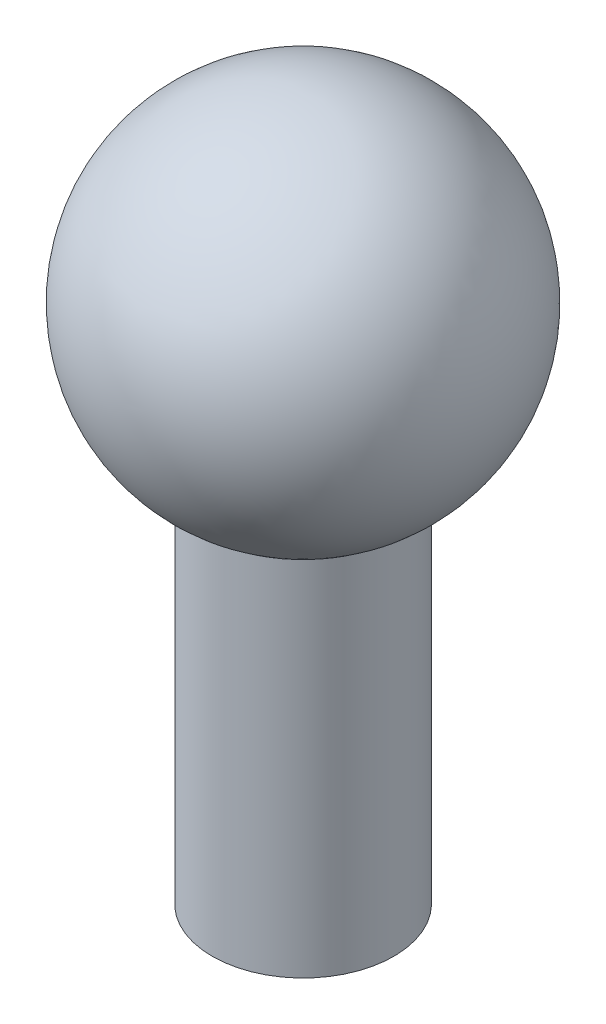
ISO-10303-21;
HEADER;
FILE_DESCRIPTION(('STEP AP214'),'2;1');
FILE_NAME('part.step','',(''),(''),'','','');
FILE_SCHEMA(('AUTOMOTIVE_DESIGN { 1 0 10303 214 1 1 1 1 }'));
ENDSEC;
DATA;
#1=APPLICATION_CONTEXT('core data for automotive mechanical design processes');
#2=APPLICATION_PROTOCOL_DEFINITION('international standard','automotive_design',2000,#1);
#3=PRODUCT_CONTEXT('',#1,'mechanical');
#4=PRODUCT('Part','Part','',(#3));
#5=PRODUCT_RELATED_PRODUCT_CATEGORY('part','',(#4));
#6=PRODUCT_DEFINITION_FORMATION('','',#4);
#7=PRODUCT_DEFINITION_CONTEXT('part definition',#1,'design');
#8=PRODUCT_DEFINITION('design','',#6,#7);
#9=PRODUCT_DEFINITION_SHAPE('','',#8);
#10=(LENGTH_UNIT() NAMED_UNIT(*) SI_UNIT(.MILLI.,.METRE.));
#11=(NAMED_UNIT(*) PLANE_ANGLE_UNIT() SI_UNIT($,.RADIAN.));
#12=(NAMED_UNIT(*) SI_UNIT($,.STERADIAN.) SOLID_ANGLE_UNIT());
#13=UNCERTAINTY_MEASURE_WITH_UNIT(LENGTH_MEASURE(1.E-05),#10,'distance_accuracy_value','');
#14=(GEOMETRIC_REPRESENTATION_CONTEXT(3) GLOBAL_UNCERTAINTY_ASSIGNED_CONTEXT((#13)) GLOBAL_UNIT_ASSIGNED_CONTEXT((#10,
#11,#12)) REPRESENTATION_CONTEXT('',''));
#15=CARTESIAN_POINT('',(0.,0.,0.));
#16=DIRECTION('',(0.,0.,1.));
#17=DIRECTION('',(1.,0.,0.));
#18=AXIS2_PLACEMENT_3D('',#15,#16,#17);
#19=CARTESIAN_POINT('',(0.,40.,0.));
#20=DIRECTION('',(0.,-1.,0.));
#21=DIRECTION('',(0.,0.,-1.));
#22=AXIS2_PLACEMENT_3D('',#19,#20,#21);
#23=CYLINDRICAL_SURFACE('',#22,10.);
#24=CARTESIAN_POINT('',(0.,40.,0.));
#25=DIRECTION('',(0.,1.,0.));
#26=DIRECTION('',(0.,0.,1.));
#27=AXIS2_PLACEMENT_3D('',#24,#25,#26);
#28=CIRCLE('',#27,10.);
#29=CARTESIAN_POINT('',(0.,40.,10.));
#30=VERTEX_POINT('',#29);
#31=EDGE_CURVE('E44',#30,#30,#28,.T.);
#32=ORIENTED_EDGE('',*,*,#31,.F.);
#33=EDGE_LOOP('',(#32));
#34=FACE_BOUND('',#33,.T.);
#35=CARTESIAN_POINT('',(0.,0.,0.));
#36=DIRECTION('',(0.,1.,0.));
#37=DIRECTION('',(0.,0.,1.));
#38=AXIS2_PLACEMENT_3D('',#35,#36,#37);
#39=CIRCLE('',#38,10.);
#40=CARTESIAN_POINT('',(0.,0.,10.));
#41=VERTEX_POINT('',#40);
#42=EDGE_CURVE('E47',#41,#41,#39,.T.);
#43=ORIENTED_EDGE('',*,*,#42,.T.);
#44=EDGE_LOOP('',(#43));
#45=FACE_BOUND('',#44,.T.);
#46=ADVANCED_FACE('F32',(#34,#45),#23,.T.);
#47=CARTESIAN_POINT('',(0.,40.,0.));
#48=DIRECTION('',(0.,1.,0.));
#49=DIRECTION('',(0.,0.,1.));
#50=AXIS2_PLACEMENT_3D('',#47,#48,#49);
#51=PLANE('',#50);
#52=CARTESIAN_POINT('',(0.,40.,-3.49148133884313E-12));
#53=DIRECTION('',(0.,1.,0.));
#54=DIRECTION('',(0.,0.,1.));
#55=AXIS2_PLACEMENT_3D('',#52,#53,#54);
#56=CIRCLE('',#55,9.98912770974172);
#57=CARTESIAN_POINT('',(0.,40.,9.98912770973823));
#58=VERTEX_POINT('',#57);
#59=EDGE_CURVE('E36',#58,#58,#56,.F.);
#60=ORIENTED_EDGE('',*,*,#59,.T.);
#61=EDGE_LOOP('',(#60));
#62=FACE_BOUND('',#61,.T.);
#63=ORIENTED_EDGE('',*,*,#31,.T.);
#64=EDGE_LOOP('',(#63));
#65=FACE_BOUND('',#64,.T.);
#66=ADVANCED_FACE('F59',(#62,#65),#51,.T.);
#67=CARTESIAN_POINT('',(0.,0.,0.));
#68=DIRECTION('',(0.,1.,0.));
#69=DIRECTION('',(0.,0.,1.));
#70=AXIS2_PLACEMENT_3D('',#67,#68,#69);
#71=PLANE('',#70);
#72=CARTESIAN_POINT('',(0.,0.,0.));
#73=DIRECTION('',(0.,-1.,0.));
#74=DIRECTION('',(0.,0.,-1.));
#75=AXIS2_PLACEMENT_3D('',#72,#73,#74);
#76=CIRCLE('',#75,7.25);
#77=CARTESIAN_POINT('',(0.,0.,-7.25));
#78=VERTEX_POINT('',#77);
#79=EDGE_CURVE('E50',#78,#78,#76,.T.);
#80=ORIENTED_EDGE('',*,*,#79,.F.);
#81=EDGE_LOOP('',(#80));
#82=FACE_BOUND('',#81,.T.);
#83=ORIENTED_EDGE('',*,*,#42,.F.);
#84=EDGE_LOOP('',(#83));
#85=FACE_BOUND('',#84,.T.);
#86=ADVANCED_FACE('F76',(#82,#85),#71,.F.);
#87=CARTESIAN_POINT('',(0.,30.,0.));
#88=DIRECTION('',(0.,-1.,0.));
#89=DIRECTION('',(0.,0.,-1.));
#90=AXIS2_PLACEMENT_3D('',#87,#88,#89);
#91=CYLINDRICAL_SURFACE('',#90,7.25);
#92=CARTESIAN_POINT('',(0.,28.,0.));
#93=DIRECTION('',(0.,-1.,0.));
#94=DIRECTION('',(0.,0.,-1.));
#95=AXIS2_PLACEMENT_3D('',#92,#93,#94);
#96=CIRCLE('',#95,7.25);
#97=CARTESIAN_POINT('',(0.,28.,-7.25));
#98=VERTEX_POINT('',#97);
#99=EDGE_CURVE('E10',#98,#98,#96,.F.);
#100=ORIENTED_EDGE('',*,*,#99,.T.);
#101=EDGE_LOOP('',(#100));
#102=FACE_BOUND('',#101,.T.);
#103=ORIENTED_EDGE('',*,*,#79,.T.);
#104=EDGE_LOOP('',(#103));
#105=FACE_BOUND('',#104,.T.);
#106=ADVANCED_FACE('F82',(#102,#105),#91,.F.);
#107=CARTESIAN_POINT('',(0.,30.,0.));
#108=DIRECTION('',(0.,-1.,0.));
#109=DIRECTION('',(0.,0.,-1.));
#110=AXIS2_PLACEMENT_3D('',#107,#108,#109);
#111=PLANE('',#110);
#112=CARTESIAN_POINT('',(0.,30.,0.));
#113=DIRECTION('',(0.,-1.,0.));
#114=DIRECTION('',(0.,0.,-1.));
#115=AXIS2_PLACEMENT_3D('',#112,#113,#114);
#116=CIRCLE('',#115,5.25);
#117=CARTESIAN_POINT('',(0.,30.,-5.25));
#118=VERTEX_POINT('',#117);
#119=EDGE_CURVE('E40',#118,#118,#116,.T.);
#120=ORIENTED_EDGE('',*,*,#119,.T.);
#121=EDGE_LOOP('',(#120));
#122=FACE_BOUND('',#121,.T.);
#123=ADVANCED_FACE('F68',(#122),#111,.T.);
#124=CARTESIAN_POINT('',(0.,28.,0.));
#125=DIRECTION('',(0.,-1.,0.));
#126=DIRECTION('',(0.,0.,-1.));
#127=AXIS2_PLACEMENT_3D('',#124,#125,#126);
#128=TOROIDAL_SURFACE('',#127,5.25,2.);
#129=ORIENTED_EDGE('',*,*,#99,.F.);
#130=EDGE_LOOP('',(#129));
#131=FACE_BOUND('',#130,.T.);
#132=ORIENTED_EDGE('',*,*,#119,.F.);
#133=EDGE_LOOP('',(#132));
#134=FACE_BOUND('',#133,.T.);
#135=ADVANCED_FACE('F34',(#131,#134),#128,.F.);
#136=CARTESIAN_POINT('',(0.,57.3267806472619,-3.49148133884313E-12));
#137=DIRECTION('',(0.,0.,-1.));
#138=DIRECTION('',(0.,1.,0.));
#139=AXIS2_PLACEMENT_3D('',#136,#137,#138);
#140=SPHERICAL_SURFACE('',#139,19.9999999999965);
#141=CARTESIAN_POINT('',(0.,57.3267806472619,-3.49148133884313E-12));
#142=DIRECTION('',(0.,1.,0.));
#143=DIRECTION('',(0.,0.,1.));
#144=AXIS2_PLACEMENT_3D('',#141,#142,#143);
#145=SPHERICAL_SURFACE('',#144,19.9999999999965);
#146=ORIENTED_EDGE('',*,*,#59,.F.);
#147=EDGE_LOOP('',(#146));
#148=FACE_BOUND('',#147,.T.);
#149=ADVANCED_FACE('F62',(#148),#145,.T.);
#150=CLOSED_SHELL('',(#46,#66,#86,#106,#123,#135,#149));
#151=MANIFOLD_SOLID_BREP('B2',#150);
#152=ADVANCED_BREP_SHAPE_REPRESENTATION('',(#18,#151),#14);
#153=SHAPE_DEFINITION_REPRESENTATION(#9,#152);
ENDSEC;
END-ISO-10303-21;
